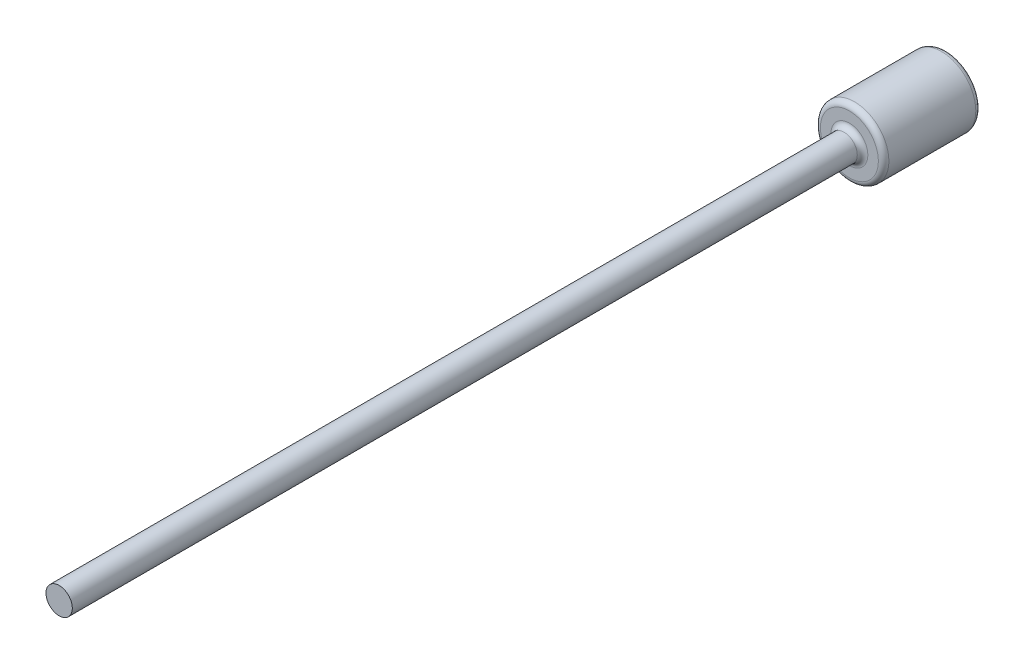
ISO-10303-21;
HEADER;
FILE_DESCRIPTION(('STEP AP214'),'2;1');
FILE_NAME('part.step','',(''),(''),'','','');
FILE_SCHEMA(('AUTOMOTIVE_DESIGN { 1 0 10303 214 1 1 1 1 }'));
ENDSEC;
DATA;
#1=APPLICATION_CONTEXT('core data for automotive mechanical design processes');
#2=APPLICATION_PROTOCOL_DEFINITION('international standard','automotive_design',2000,#1);
#3=PRODUCT_CONTEXT('',#1,'mechanical');
#4=PRODUCT('Part','Part','',(#3));
#5=PRODUCT_RELATED_PRODUCT_CATEGORY('part','',(#4));
#6=PRODUCT_DEFINITION_FORMATION('','',#4);
#7=PRODUCT_DEFINITION_CONTEXT('part definition',#1,'design');
#8=PRODUCT_DEFINITION('design','',#6,#7);
#9=PRODUCT_DEFINITION_SHAPE('','',#8);
#10=(LENGTH_UNIT() NAMED_UNIT(*) SI_UNIT(.MILLI.,.METRE.));
#11=(NAMED_UNIT(*) PLANE_ANGLE_UNIT() SI_UNIT($,.RADIAN.));
#12=(NAMED_UNIT(*) SI_UNIT($,.STERADIAN.) SOLID_ANGLE_UNIT());
#13=UNCERTAINTY_MEASURE_WITH_UNIT(LENGTH_MEASURE(1.E-05),#10,'distance_accuracy_value','');
#14=(GEOMETRIC_REPRESENTATION_CONTEXT(3) GLOBAL_UNCERTAINTY_ASSIGNED_CONTEXT((#13)) GLOBAL_UNIT_ASSIGNED_CONTEXT((#10,
#11,#12)) REPRESENTATION_CONTEXT('',''));
#15=CARTESIAN_POINT('',(0.,0.,0.));
#16=DIRECTION('',(0.,0.,1.));
#17=DIRECTION('',(1.,0.,0.));
#18=AXIS2_PLACEMENT_3D('',#15,#16,#17);
#19=CARTESIAN_POINT('',(0.,0.,-37.));
#20=DIRECTION('',(0.,0.,1.));
#21=DIRECTION('',(1.,0.,0.));
#22=AXIS2_PLACEMENT_3D('',#19,#20,#21);
#23=CYLINDRICAL_SURFACE('',#22,13.);
#24=CARTESIAN_POINT('',(0.,0.,-35.));
#25=DIRECTION('',(0.,0.,1.));
#26=DIRECTION('',(1.,0.,0.));
#27=AXIS2_PLACEMENT_3D('',#24,#25,#26);
#28=CIRCLE('',#27,13.);
#29=CARTESIAN_POINT('',(13.,0.,-35.));
#30=VERTEX_POINT('',#29);
#31=EDGE_CURVE('E50',#30,#30,#28,.T.);
#32=ORIENTED_EDGE('',*,*,#31,.T.);
#33=EDGE_LOOP('',(#32));
#34=FACE_BOUND('',#33,.T.);
#35=CARTESIAN_POINT('',(0.,0.,-2.));
#36=DIRECTION('',(0.,0.,1.));
#37=DIRECTION('',(1.,0.,0.));
#38=AXIS2_PLACEMENT_3D('',#35,#36,#37);
#39=CIRCLE('',#38,13.);
#40=CARTESIAN_POINT('',(13.,0.,-2.));
#41=VERTEX_POINT('',#40);
#42=EDGE_CURVE('E53',#41,#41,#39,.F.);
#43=ORIENTED_EDGE('',*,*,#42,.T.);
#44=EDGE_LOOP('',(#43));
#45=FACE_BOUND('',#44,.T.);
#46=ADVANCED_FACE('F30',(#34,#45),#23,.T.);
#47=CARTESIAN_POINT('',(0.,0.,-37.));
#48=DIRECTION('',(0.,0.,1.));
#49=DIRECTION('',(1.,0.,0.));
#50=AXIS2_PLACEMENT_3D('',#47,#48,#49);
#51=PLANE('',#50);
#52=CARTESIAN_POINT('',(0.,0.,-37.));
#53=DIRECTION('',(0.,0.,1.));
#54=DIRECTION('',(1.,0.,0.));
#55=AXIS2_PLACEMENT_3D('',#52,#53,#54);
#56=CIRCLE('',#55,11.);
#57=CARTESIAN_POINT('',(11.,0.,-37.));
#58=VERTEX_POINT('',#57);
#59=EDGE_CURVE('E45',#58,#58,#56,.F.);
#60=ORIENTED_EDGE('',*,*,#59,.T.);
#61=EDGE_LOOP('',(#60));
#62=FACE_BOUND('',#61,.T.);
#63=ADVANCED_FACE('F72',(#62),#51,.F.);
#64=CARTESIAN_POINT('',(0.,0.,0.));
#65=DIRECTION('',(0.,0.,1.));
#66=DIRECTION('',(1.,0.,0.));
#67=AXIS2_PLACEMENT_3D('',#64,#65,#66);
#68=PLANE('',#67);
#69=CARTESIAN_POINT('',(0.,0.,0.));
#70=DIRECTION('',(0.,0.,1.));
#71=DIRECTION('',(1.,0.,0.));
#72=AXIS2_PLACEMENT_3D('',#69,#70,#71);
#73=CIRCLE('',#72,11.);
#74=CARTESIAN_POINT('',(11.,0.,0.));
#75=VERTEX_POINT('',#74);
#76=EDGE_CURVE('E37',#75,#75,#73,.T.);
#77=ORIENTED_EDGE('',*,*,#76,.T.);
#78=EDGE_LOOP('',(#77));
#79=FACE_BOUND('',#78,.T.);
#80=CARTESIAN_POINT('',(0.,0.,0.));
#81=DIRECTION('',(0.,0.,1.));
#82=DIRECTION('',(1.,0.,0.));
#83=AXIS2_PLACEMENT_3D('',#80,#81,#82);
#84=CIRCLE('',#83,7.);
#85=CARTESIAN_POINT('',(7.,0.,0.));
#86=VERTEX_POINT('',#85);
#87=EDGE_CURVE('E41',#86,#86,#84,.F.);
#88=ORIENTED_EDGE('',*,*,#87,.T.);
#89=EDGE_LOOP('',(#88));
#90=FACE_BOUND('',#89,.T.);
#91=ADVANCED_FACE('F64',(#79,#90),#68,.T.);
#92=CARTESIAN_POINT('',(0.,0.,280.));
#93=DIRECTION('',(0.,0.,-1.));
#94=DIRECTION('',(-1.,0.,0.));
#95=AXIS2_PLACEMENT_3D('',#92,#93,#94);
#96=CYLINDRICAL_SURFACE('',#95,5.);
#97=CARTESIAN_POINT('',(0.,0.,2.));
#98=DIRECTION('',(0.,0.,1.));
#99=DIRECTION('',(1.,0.,0.));
#100=AXIS2_PLACEMENT_3D('',#97,#98,#99);
#101=CIRCLE('',#100,5.);
#102=CARTESIAN_POINT('',(5.,0.,2.));
#103=VERTEX_POINT('',#102);
#104=EDGE_CURVE('E10',#103,#103,#101,.T.);
#105=ORIENTED_EDGE('',*,*,#104,.T.);
#106=EDGE_LOOP('',(#105));
#107=FACE_BOUND('',#106,.T.);
#108=CARTESIAN_POINT('',(0.,0.,300.));
#109=DIRECTION('',(0.,0.,1.));
#110=DIRECTION('',(1.,0.,0.));
#111=AXIS2_PLACEMENT_3D('',#108,#109,#110);
#112=CIRCLE('',#111,5.);
#113=CARTESIAN_POINT('',(5.,0.,300.));
#114=VERTEX_POINT('',#113);
#115=EDGE_CURVE('E56',#114,#114,#112,.T.);
#116=ORIENTED_EDGE('',*,*,#115,.F.);
#117=EDGE_LOOP('',(#116));
#118=FACE_BOUND('',#117,.T.);
#119=ADVANCED_FACE('F62',(#107,#118),#96,.T.);
#120=CARTESIAN_POINT('',(0.,0.,300.));
#121=DIRECTION('',(0.,0.,1.));
#122=DIRECTION('',(1.,0.,0.));
#123=AXIS2_PLACEMENT_3D('',#120,#121,#122);
#124=PLANE('',#123);
#125=ORIENTED_EDGE('',*,*,#115,.T.);
#126=EDGE_LOOP('',(#125));
#127=FACE_BOUND('',#126,.T.);
#128=ADVANCED_FACE('F60',(#127),#124,.T.);
#129=CARTESIAN_POINT('',(0.,0.,-35.));
#130=DIRECTION('',(0.,0.,1.));
#131=DIRECTION('',(1.,0.,0.));
#132=AXIS2_PLACEMENT_3D('',#129,#130,#131);
#133=TOROIDAL_SURFACE('',#132,11.,2.);
#134=ORIENTED_EDGE('',*,*,#59,.F.);
#135=EDGE_LOOP('',(#134));
#136=FACE_BOUND('',#135,.T.);
#137=ORIENTED_EDGE('',*,*,#31,.F.);
#138=EDGE_LOOP('',(#137));
#139=FACE_BOUND('',#138,.T.);
#140=ADVANCED_FACE('F70',(#136,#139),#133,.T.);
#141=CARTESIAN_POINT('',(0.,0.,-2.));
#142=DIRECTION('',(0.,0.,1.));
#143=DIRECTION('',(1.,0.,0.));
#144=AXIS2_PLACEMENT_3D('',#141,#142,#143);
#145=TOROIDAL_SURFACE('',#144,11.,2.);
#146=ORIENTED_EDGE('',*,*,#42,.F.);
#147=EDGE_LOOP('',(#146));
#148=FACE_BOUND('',#147,.T.);
#149=ORIENTED_EDGE('',*,*,#76,.F.);
#150=EDGE_LOOP('',(#149));
#151=FACE_BOUND('',#150,.T.);
#152=ADVANCED_FACE('F85',(#148,#151),#145,.T.);
#153=CARTESIAN_POINT('',(0.,0.,2.));
#154=DIRECTION('',(0.,0.,1.));
#155=DIRECTION('',(1.,0.,0.));
#156=AXIS2_PLACEMENT_3D('',#153,#154,#155);
#157=TOROIDAL_SURFACE('',#156,7.,2.);
#158=ORIENTED_EDGE('',*,*,#87,.F.);
#159=EDGE_LOOP('',(#158));
#160=FACE_BOUND('',#159,.T.);
#161=ORIENTED_EDGE('',*,*,#104,.F.);
#162=EDGE_LOOP('',(#161));
#163=FACE_BOUND('',#162,.T.);
#164=ADVANCED_FACE('F32',(#160,#163),#157,.F.);
#165=CLOSED_SHELL('',(#46,#63,#91,#119,#128,#140,#152,#164));
#166=MANIFOLD_SOLID_BREP('B2',#165);
#167=ADVANCED_BREP_SHAPE_REPRESENTATION('',(#18,#166),#14);
#168=SHAPE_DEFINITION_REPRESENTATION(#9,#167);
ENDSEC;
END-ISO-10303-21;
